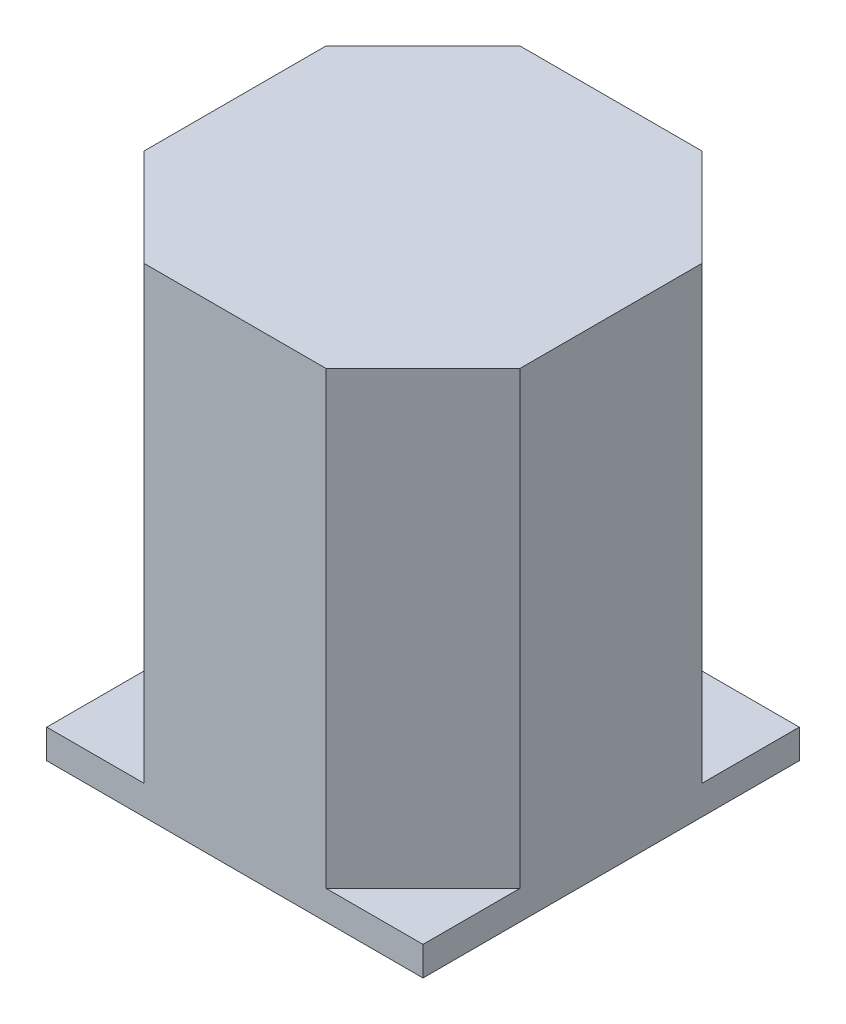
ISO-10303-21;
HEADER;
FILE_DESCRIPTION(('STEP AP214'),'2;1');
FILE_NAME('part.step','',(''),(''),'','','');
FILE_SCHEMA(('AUTOMOTIVE_DESIGN { 1 0 10303 214 1 1 1 1 }'));
ENDSEC;
DATA;
#1=APPLICATION_CONTEXT('core data for automotive mechanical design processes');
#2=APPLICATION_PROTOCOL_DEFINITION('international standard','automotive_design',2000,#1);
#3=PRODUCT_CONTEXT('',#1,'mechanical');
#4=PRODUCT('Part','Part','',(#3));
#5=PRODUCT_RELATED_PRODUCT_CATEGORY('part','',(#4));
#6=PRODUCT_DEFINITION_FORMATION('','',#4);
#7=PRODUCT_DEFINITION_CONTEXT('part definition',#1,'design');
#8=PRODUCT_DEFINITION('design','',#6,#7);
#9=PRODUCT_DEFINITION_SHAPE('','',#8);
#10=(LENGTH_UNIT() NAMED_UNIT(*) SI_UNIT(.MILLI.,.METRE.));
#11=(NAMED_UNIT(*) PLANE_ANGLE_UNIT() SI_UNIT($,.RADIAN.));
#12=(NAMED_UNIT(*) SI_UNIT($,.STERADIAN.) SOLID_ANGLE_UNIT());
#13=UNCERTAINTY_MEASURE_WITH_UNIT(LENGTH_MEASURE(1.E-05),#10,'distance_accuracy_value','');
#14=(GEOMETRIC_REPRESENTATION_CONTEXT(3) GLOBAL_UNCERTAINTY_ASSIGNED_CONTEXT((#13)) GLOBAL_UNIT_ASSIGNED_CONTEXT((#10,
#11,#12)) REPRESENTATION_CONTEXT('',''));
#15=CARTESIAN_POINT('',(0.,0.,0.));
#16=DIRECTION('',(0.,0.,1.));
#17=DIRECTION('',(1.,0.,0.));
#18=AXIS2_PLACEMENT_3D('',#15,#16,#17);
#19=CARTESIAN_POINT('',(260.145154707633,249.495838716891,675.18038003442));
#20=DIRECTION('',(0.,1.,0.));
#21=DIRECTION('',(1.,0.,0.));
#22=AXIS2_PLACEMENT_3D('',#19,#20,#21);
#23=PLANE('',#22);
#24=DIRECTION('',(0.,0.,1.));
#25=VECTOR('',#24,1.);
#26=CARTESIAN_POINT('',(337.645154707633,249.495838716886,675.180380034425));
#27=LINE('',#26,#25);
#28=CARTESIAN_POINT('',(337.645154707636,249.495838716886,637.680380034425));
#29=VERTEX_POINT('',#28);
#30=CARTESIAN_POINT('',(337.645154707631,249.495838716886,712.680380034425));
#31=VERTEX_POINT('',#30);
#32=EDGE_CURVE('E135',#29,#31,#27,.T.);
#33=ORIENTED_EDGE('',*,*,#32,.F.);
#34=DIRECTION('',(0.707106781186502,0.,0.707106781186593));
#35=VECTOR('',#34,1.);
#36=CARTESIAN_POINT('',(317.645154707636,249.495838716887,617.680380034424));
#37=LINE('',#36,#35);
#38=CARTESIAN_POINT('',(297.645154707638,249.495838716888,597.680380034422));
#39=VERTEX_POINT('',#38);
#40=EDGE_CURVE('E237',#29,#39,#37,.F.);
#41=ORIENTED_EDGE('',*,*,#40,.T.);
#42=DIRECTION('',(1.,0.,0.));
#43=VECTOR('',#42,1.);
#44=CARTESIAN_POINT('',(260.145154707638,249.495838716891,597.68038003442));
#45=LINE('',#44,#43);
#46=CARTESIAN_POINT('',(222.645154707638,249.495838716893,597.680380034418));
#47=VERTEX_POINT('',#46);
#48=EDGE_CURVE('E139',#47,#39,#45,.T.);
#49=ORIENTED_EDGE('',*,*,#48,.F.);
#50=DIRECTION('',(0.707106781186594,0.,-0.707106781186501));
#51=VECTOR('',#50,1.);
#52=CARTESIAN_POINT('',(202.645154707636,249.495838716894,617.680380034416));
#53=LINE('',#52,#51);
#54=CARTESIAN_POINT('',(182.645154707635,249.495838716896,637.680380034415));
#55=VERTEX_POINT('',#54);
#56=EDGE_CURVE('E232',#47,#55,#53,.F.);
#57=ORIENTED_EDGE('',*,*,#56,.T.);
#58=DIRECTION('',(0.,0.,-1.));
#59=VECTOR('',#58,1.);
#60=CARTESIAN_POINT('',(182.645154707633,249.495838716896,675.180380034415));
#61=LINE('',#60,#59);
#62=CARTESIAN_POINT('',(182.645154707631,249.495838716896,712.680380034415));
#63=VERTEX_POINT('',#62);
#64=EDGE_CURVE('E258',#63,#55,#61,.T.);
#65=ORIENTED_EDGE('',*,*,#64,.F.);
#66=DIRECTION('',(-0.707106781186502,0.,-0.707106781186593));
#67=VECTOR('',#66,1.);
#68=CARTESIAN_POINT('',(202.645154707629,249.495838716894,732.680380034416));
#69=LINE('',#68,#67);
#70=CARTESIAN_POINT('',(222.645154707628,249.495838716893,752.680380034418));
#71=VERTEX_POINT('',#70);
#72=EDGE_CURVE('E244',#63,#71,#69,.F.);
#73=ORIENTED_EDGE('',*,*,#72,.T.);
#74=DIRECTION('',(-1.,0.,0.));
#75=VECTOR('',#74,1.);
#76=CARTESIAN_POINT('',(260.145154707628,249.495838716891,752.68038003442));
#77=LINE('',#76,#75);
#78=CARTESIAN_POINT('',(297.645154707628,249.495838716888,752.680380034422));
#79=VERTEX_POINT('',#78);
#80=EDGE_CURVE('E256',#79,#71,#77,.T.);
#81=ORIENTED_EDGE('',*,*,#80,.F.);
#82=DIRECTION('',(-0.707106781186594,0.,0.707106781186501));
#83=VECTOR('',#82,1.);
#84=CARTESIAN_POINT('',(317.645154707629,249.495838716887,732.680380034424));
#85=LINE('',#84,#83);
#86=EDGE_CURVE('E240',#79,#31,#85,.F.);
#87=ORIENTED_EDGE('',*,*,#86,.T.);
#88=EDGE_LOOP('',(#33,#41,#49,#57,#65,#73,#81,#87));
#89=FACE_BOUND('',#88,.T.);
#90=ADVANCED_FACE('F16',(#89),#23,.T.);
#91=CARTESIAN_POINT('',(260.145154707616,63.9958387168907,752.68038003442));
#92=DIRECTION('',(0.,0.,1.));
#93=DIRECTION('',(0.,-1.,0.));
#94=AXIS2_PLACEMENT_3D('',#91,#92,#93);
#95=PLANE('',#94);
#96=DIRECTION('',(0.,-1.,0.));
#97=VECTOR('',#96,1.);
#98=CARTESIAN_POINT('',(222.645154707616,63.9958387168932,752.680380034418));
#99=LINE('',#98,#97);
#100=CARTESIAN_POINT('',(222.645154707616,63.9958387168932,752.680380034418));
#101=VERTEX_POINT('',#100);
#102=EDGE_CURVE('E185',#71,#101,#99,.T.);
#103=ORIENTED_EDGE('',*,*,#102,.T.);
#104=DIRECTION('',(-1.,0.,0.));
#105=VECTOR('',#104,1.);
#106=CARTESIAN_POINT('',(337.645154707616,63.9958387168857,752.680380034425));
#107=LINE('',#106,#105);
#108=CARTESIAN_POINT('',(182.645154707616,63.9958387168959,752.680380034415));
#109=VERTEX_POINT('',#108);
#110=EDGE_CURVE('E151',#101,#109,#107,.T.);
#111=ORIENTED_EDGE('',*,*,#110,.T.);
#112=DIRECTION('',(0.,-1.,0.));
#113=VECTOR('',#112,1.);
#114=CARTESIAN_POINT('',(182.645154707615,51.9958387168958,752.680380034415));
#115=LINE('',#114,#113);
#116=CARTESIAN_POINT('',(182.645154707615,51.9958387168958,752.680380034415));
#117=VERTEX_POINT('',#116);
#118=EDGE_CURVE('E127',#109,#117,#115,.T.);
#119=ORIENTED_EDGE('',*,*,#118,.T.);
#120=DIRECTION('',(-1.,0.,0.));
#121=VECTOR('',#120,1.);
#122=CARTESIAN_POINT('',(337.645154707615,51.9958387168857,752.680380034425));
#123=LINE('',#122,#121);
#124=CARTESIAN_POINT('',(337.645154707615,51.9958387168857,752.680380034425));
#125=VERTEX_POINT('',#124);
#126=EDGE_CURVE('E182',#125,#117,#123,.T.);
#127=ORIENTED_EDGE('',*,*,#126,.F.);
#128=DIRECTION('',(0.,-1.,0.));
#129=VECTOR('',#128,1.);
#130=CARTESIAN_POINT('',(337.645154707615,51.9958387168857,752.680380034425));
#131=LINE('',#130,#129);
#132=CARTESIAN_POINT('',(337.645154707616,63.9958387168857,752.680380034425));
#133=VERTEX_POINT('',#132);
#134=EDGE_CURVE('E152',#133,#125,#131,.T.);
#135=ORIENTED_EDGE('',*,*,#134,.F.);
#136=CARTESIAN_POINT('',(297.645154707616,63.9958387168883,752.680380034422));
#137=VERTEX_POINT('',#136);
#138=EDGE_CURVE('E186',#133,#137,#107,.T.);
#139=ORIENTED_EDGE('',*,*,#138,.T.);
#140=DIRECTION('',(0.,1.,0.));
#141=VECTOR('',#140,1.);
#142=CARTESIAN_POINT('',(297.645154707616,63.9958387168883,752.680380034422));
#143=LINE('',#142,#141);
#144=EDGE_CURVE('E198',#137,#79,#143,.T.);
#145=ORIENTED_EDGE('',*,*,#144,.T.);
#146=ORIENTED_EDGE('',*,*,#80,.T.);
#147=EDGE_LOOP('',(#103,#111,#119,#127,#135,#139,#145,#146));
#148=FACE_BOUND('',#147,.T.);
#149=ADVANCED_FACE('F180',(#148),#95,.T.);
#150=CARTESIAN_POINT('',(182.645154707621,63.9958387168959,675.180380034415));
#151=DIRECTION('',(-1.,0.,0.));
#152=DIRECTION('',(0.,1.,0.));
#153=AXIS2_PLACEMENT_3D('',#150,#151,#152);
#154=PLANE('',#153);
#155=DIRECTION('',(0.,-1.,0.));
#156=VECTOR('',#155,1.);
#157=CARTESIAN_POINT('',(182.645154707624,63.9958387168959,637.680380034415));
#158=LINE('',#157,#156);
#159=CARTESIAN_POINT('',(182.645154707624,63.9958387168959,637.680380034415));
#160=VERTEX_POINT('',#159);
#161=EDGE_CURVE('E24',#55,#160,#158,.T.);
#162=ORIENTED_EDGE('',*,*,#161,.T.);
#163=DIRECTION('',(0.,0.,1.));
#164=VECTOR('',#163,1.);
#165=CARTESIAN_POINT('',(182.645154707626,63.9958387168959,597.680380034415));
#166=LINE('',#165,#164);
#167=CARTESIAN_POINT('',(182.645154707626,63.9958387168959,597.680380034415));
#168=VERTEX_POINT('',#167);
#169=EDGE_CURVE('E166',#168,#160,#166,.T.);
#170=ORIENTED_EDGE('',*,*,#169,.F.);
#171=DIRECTION('',(0.,-1.,0.));
#172=VECTOR('',#171,1.);
#173=CARTESIAN_POINT('',(182.645154707625,51.9958387168958,597.680380034415));
#174=LINE('',#173,#172);
#175=CARTESIAN_POINT('',(182.645154707625,51.9958387168958,597.680380034415));
#176=VERTEX_POINT('',#175);
#177=EDGE_CURVE('E141',#168,#176,#174,.T.);
#178=ORIENTED_EDGE('',*,*,#177,.T.);
#179=DIRECTION('',(0.,0.,1.));
#180=VECTOR('',#179,1.);
#181=CARTESIAN_POINT('',(182.645154707625,51.9958387168958,597.680380034415));
#182=LINE('',#181,#180);
#183=EDGE_CURVE('E148',#176,#117,#182,.T.);
#184=ORIENTED_EDGE('',*,*,#183,.T.);
#185=ORIENTED_EDGE('',*,*,#118,.F.);
#186=CARTESIAN_POINT('',(182.645154707619,63.9958387168959,712.680380034415));
#187=VERTEX_POINT('',#186);
#188=EDGE_CURVE('E116',#187,#109,#166,.T.);
#189=ORIENTED_EDGE('',*,*,#188,.F.);
#190=DIRECTION('',(0.,1.,0.));
#191=VECTOR('',#190,1.);
#192=CARTESIAN_POINT('',(182.645154707619,63.9958387168959,712.680380034415));
#193=LINE('',#192,#191);
#194=EDGE_CURVE('E11',#187,#63,#193,.T.);
#195=ORIENTED_EDGE('',*,*,#194,.T.);
#196=ORIENTED_EDGE('',*,*,#64,.T.);
#197=EDGE_LOOP('',(#162,#170,#178,#184,#185,#189,#195,#196));
#198=FACE_BOUND('',#197,.T.);
#199=ADVANCED_FACE('F178',(#198),#154,.T.);
#200=CARTESIAN_POINT('',(260.145154707626,63.9958387168907,597.68038003442));
#201=DIRECTION('',(0.,0.,-1.));
#202=DIRECTION('',(0.,1.,0.));
#203=AXIS2_PLACEMENT_3D('',#200,#201,#202);
#204=PLANE('',#203);
#205=ORIENTED_EDGE('',*,*,#48,.T.);
#206=DIRECTION('',(0.,-1.,0.));
#207=VECTOR('',#206,1.);
#208=CARTESIAN_POINT('',(297.645154707626,63.9958387168883,597.680380034422));
#209=LINE('',#208,#207);
#210=CARTESIAN_POINT('',(297.645154707626,63.9958387168883,597.680380034422));
#211=VERTEX_POINT('',#210);
#212=EDGE_CURVE('E126',#39,#211,#209,.T.);
#213=ORIENTED_EDGE('',*,*,#212,.T.);
#214=DIRECTION('',(-1.,0.,0.));
#215=VECTOR('',#214,1.);
#216=CARTESIAN_POINT('',(337.645154707626,63.9958387168857,597.680380034425));
#217=LINE('',#216,#215);
#218=CARTESIAN_POINT('',(337.645154707626,63.9958387168857,597.680380034425));
#219=VERTEX_POINT('',#218);
#220=EDGE_CURVE('E110',#219,#211,#217,.T.);
#221=ORIENTED_EDGE('',*,*,#220,.F.);
#222=DIRECTION('',(0.,-1.,0.));
#223=VECTOR('',#222,1.);
#224=CARTESIAN_POINT('',(337.645154707625,51.9958387168857,597.680380034425));
#225=LINE('',#224,#223);
#226=CARTESIAN_POINT('',(337.645154707625,51.9958387168857,597.680380034425));
#227=VERTEX_POINT('',#226);
#228=EDGE_CURVE('E124',#219,#227,#225,.T.);
#229=ORIENTED_EDGE('',*,*,#228,.T.);
#230=DIRECTION('',(-1.,0.,0.));
#231=VECTOR('',#230,1.);
#232=CARTESIAN_POINT('',(337.645154707625,51.9958387168857,597.680380034425));
#233=LINE('',#232,#231);
#234=EDGE_CURVE('E136',#227,#176,#233,.T.);
#235=ORIENTED_EDGE('',*,*,#234,.T.);
#236=ORIENTED_EDGE('',*,*,#177,.F.);
#237=CARTESIAN_POINT('',(222.645154707626,63.9958387168932,597.680380034418));
#238=VERTEX_POINT('',#237);
#239=EDGE_CURVE('E128',#238,#168,#217,.T.);
#240=ORIENTED_EDGE('',*,*,#239,.F.);
#241=DIRECTION('',(0.,1.,0.));
#242=VECTOR('',#241,1.);
#243=CARTESIAN_POINT('',(222.645154707626,63.9958387168932,597.680380034418));
#244=LINE('',#243,#242);
#245=EDGE_CURVE('E224',#238,#47,#244,.T.);
#246=ORIENTED_EDGE('',*,*,#245,.T.);
#247=EDGE_LOOP('',(#205,#213,#221,#229,#235,#236,#240,#246));
#248=FACE_BOUND('',#247,.T.);
#249=ADVANCED_FACE('F122',(#248),#204,.T.);
#250=CARTESIAN_POINT('',(337.645154707621,63.9958387168857,675.180380034425));
#251=DIRECTION('',(1.,0.,0.));
#252=DIRECTION('',(0.,-1.,0.));
#253=AXIS2_PLACEMENT_3D('',#250,#251,#252);
#254=PLANE('',#253);
#255=DIRECTION('',(0.,-1.,0.));
#256=VECTOR('',#255,1.);
#257=CARTESIAN_POINT('',(337.645154707619,63.9958387168857,712.680380034425));
#258=LINE('',#257,#256);
#259=CARTESIAN_POINT('',(337.645154707619,63.9958387168857,712.680380034425));
#260=VERTEX_POINT('',#259);
#261=EDGE_CURVE('E233',#31,#260,#258,.T.);
#262=ORIENTED_EDGE('',*,*,#261,.T.);
#263=DIRECTION('',(0.,0.,1.));
#264=VECTOR('',#263,1.);
#265=CARTESIAN_POINT('',(337.645154707626,63.9958387168857,597.680380034425));
#266=LINE('',#265,#264);
#267=EDGE_CURVE('E117',#260,#133,#266,.T.);
#268=ORIENTED_EDGE('',*,*,#267,.T.);
#269=ORIENTED_EDGE('',*,*,#134,.T.);
#270=DIRECTION('',(0.,0.,1.));
#271=VECTOR('',#270,1.);
#272=CARTESIAN_POINT('',(337.645154707625,51.9958387168857,597.680380034425));
#273=LINE('',#272,#271);
#274=EDGE_CURVE('E133',#227,#125,#273,.T.);
#275=ORIENTED_EDGE('',*,*,#274,.F.);
#276=ORIENTED_EDGE('',*,*,#228,.F.);
#277=CARTESIAN_POINT('',(337.645154707624,63.9958387168857,637.680380034425));
#278=VERTEX_POINT('',#277);
#279=EDGE_CURVE('E107',#219,#278,#266,.T.);
#280=ORIENTED_EDGE('',*,*,#279,.T.);
#281=DIRECTION('',(0.,1.,0.));
#282=VECTOR('',#281,1.);
#283=CARTESIAN_POINT('',(337.645154707624,63.9958387168857,637.680380034425));
#284=LINE('',#283,#282);
#285=EDGE_CURVE('E230',#278,#29,#284,.T.);
#286=ORIENTED_EDGE('',*,*,#285,.T.);
#287=ORIENTED_EDGE('',*,*,#32,.T.);
#288=EDGE_LOOP('',(#262,#268,#269,#275,#276,#280,#286,#287));
#289=FACE_BOUND('',#288,.T.);
#290=ADVANCED_FACE('F130',(#289),#254,.T.);
#291=CARTESIAN_POINT('',(337.645154707624,63.9958387168857,637.680380034425));
#292=DIRECTION('',(-0.707106781186593,0.,0.707106781186502));
#293=DIRECTION('',(0.707106781186502,0.,0.707106781186593));
#294=AXIS2_PLACEMENT_3D('',#291,#292,#293);
#295=PLANE('',#294);
#296=DIRECTION('',(-0.707106781186502,0.,-0.707106781186593));
#297=VECTOR('',#296,1.);
#298=CARTESIAN_POINT('',(317.645154707624,63.995838716887,617.680380034424));
#299=LINE('',#298,#297);
#300=EDGE_CURVE('E112',#211,#278,#299,.F.);
#301=ORIENTED_EDGE('',*,*,#300,.F.);
#302=ORIENTED_EDGE('',*,*,#212,.F.);
#303=ORIENTED_EDGE('',*,*,#40,.F.);
#304=ORIENTED_EDGE('',*,*,#285,.F.);
#305=EDGE_LOOP('',(#301,#302,#303,#304));
#306=FACE_BOUND('',#305,.T.);
#307=ADVANCED_FACE('F261',(#306),#295,.F.);
#308=CARTESIAN_POINT('',(297.645154707616,63.9958387168883,752.680380034422));
#309=DIRECTION('',(-0.707106781186501,0.,-0.707106781186594));
#310=DIRECTION('',(-0.707106781186594,0.,0.707106781186501));
#311=AXIS2_PLACEMENT_3D('',#308,#309,#310);
#312=PLANE('',#311);
#313=DIRECTION('',(0.707106781186594,0.,-0.707106781186501));
#314=VECTOR('',#313,1.);
#315=CARTESIAN_POINT('',(317.645154707617,63.995838716887,732.680380034424));
#316=LINE('',#315,#314);
#317=EDGE_CURVE('E204',#260,#137,#316,.F.);
#318=ORIENTED_EDGE('',*,*,#317,.F.);
#319=ORIENTED_EDGE('',*,*,#261,.F.);
#320=ORIENTED_EDGE('',*,*,#86,.F.);
#321=ORIENTED_EDGE('',*,*,#144,.F.);
#322=EDGE_LOOP('',(#318,#319,#320,#321));
#323=FACE_BOUND('',#322,.T.);
#324=ADVANCED_FACE('F262',(#323),#312,.F.);
#325=CARTESIAN_POINT('',(182.645154707619,63.9958387168959,712.680380034415));
#326=DIRECTION('',(0.707106781186593,0.,-0.707106781186502));
#327=DIRECTION('',(-0.707106781186502,0.,-0.707106781186593));
#328=AXIS2_PLACEMENT_3D('',#325,#326,#327);
#329=PLANE('',#328);
#330=DIRECTION('',(0.707106781186502,0.,0.707106781186593));
#331=VECTOR('',#330,1.);
#332=CARTESIAN_POINT('',(202.645154707617,63.9958387168945,732.680380034416));
#333=LINE('',#332,#331);
#334=EDGE_CURVE('E176',#101,#187,#333,.F.);
#335=ORIENTED_EDGE('',*,*,#334,.F.);
#336=ORIENTED_EDGE('',*,*,#102,.F.);
#337=ORIENTED_EDGE('',*,*,#72,.F.);
#338=ORIENTED_EDGE('',*,*,#194,.F.);
#339=EDGE_LOOP('',(#335,#336,#337,#338));
#340=FACE_BOUND('',#339,.T.);
#341=ADVANCED_FACE('F265',(#340),#329,.F.);
#342=CARTESIAN_POINT('',(222.645154707626,63.9958387168932,597.680380034418));
#343=DIRECTION('',(0.707106781186501,0.,0.707106781186594));
#344=DIRECTION('',(0.707106781186594,0.,-0.707106781186501));
#345=AXIS2_PLACEMENT_3D('',#342,#343,#344);
#346=PLANE('',#345);
#347=DIRECTION('',(-0.707106781186594,0.,0.707106781186501));
#348=VECTOR('',#347,1.);
#349=CARTESIAN_POINT('',(202.645154707624,63.9958387168945,617.680380034416));
#350=LINE('',#349,#348);
#351=EDGE_CURVE('E209',#160,#238,#350,.F.);
#352=ORIENTED_EDGE('',*,*,#351,.F.);
#353=ORIENTED_EDGE('',*,*,#161,.F.);
#354=ORIENTED_EDGE('',*,*,#56,.F.);
#355=ORIENTED_EDGE('',*,*,#245,.F.);
#356=EDGE_LOOP('',(#352,#353,#354,#355));
#357=FACE_BOUND('',#356,.T.);
#358=ADVANCED_FACE('F272',(#357),#346,.F.);
#359=CARTESIAN_POINT('',(337.645154707616,63.9958387168857,752.680380034425));
#360=DIRECTION('',(0.,1.,0.));
#361=DIRECTION('',(1.,0.,0.));
#362=AXIS2_PLACEMENT_3D('',#359,#360,#361);
#363=PLANE('',#362);
#364=ORIENTED_EDGE('',*,*,#220,.T.);
#365=ORIENTED_EDGE('',*,*,#300,.T.);
#366=ORIENTED_EDGE('',*,*,#279,.F.);
#367=EDGE_LOOP('',(#364,#365,#366));
#368=FACE_BOUND('',#367,.T.);
#369=ADVANCED_FACE('F109',(#368),#363,.T.);
#370=ORIENTED_EDGE('',*,*,#267,.F.);
#371=ORIENTED_EDGE('',*,*,#317,.T.);
#372=ORIENTED_EDGE('',*,*,#138,.F.);
#373=EDGE_LOOP('',(#370,#371,#372));
#374=FACE_BOUND('',#373,.T.);
#375=ADVANCED_FACE('F202',(#374),#363,.T.);
#376=ORIENTED_EDGE('',*,*,#110,.F.);
#377=ORIENTED_EDGE('',*,*,#334,.T.);
#378=ORIENTED_EDGE('',*,*,#188,.T.);
#379=EDGE_LOOP('',(#376,#377,#378));
#380=FACE_BOUND('',#379,.T.);
#381=ADVANCED_FACE('F175',(#380),#363,.T.);
#382=ORIENTED_EDGE('',*,*,#169,.T.);
#383=ORIENTED_EDGE('',*,*,#351,.T.);
#384=ORIENTED_EDGE('',*,*,#239,.T.);
#385=EDGE_LOOP('',(#382,#383,#384));
#386=FACE_BOUND('',#385,.T.);
#387=ADVANCED_FACE('F336',(#386),#363,.T.);
#388=CARTESIAN_POINT('',(337.645154707625,51.9958387168857,597.680380034425));
#389=DIRECTION('',(0.,-1.,0.));
#390=DIRECTION('',(-1.,0.,0.));
#391=AXIS2_PLACEMENT_3D('',#388,#389,#390);
#392=PLANE('',#391);
#393=ORIENTED_EDGE('',*,*,#234,.F.);
#394=ORIENTED_EDGE('',*,*,#274,.T.);
#395=ORIENTED_EDGE('',*,*,#126,.T.);
#396=ORIENTED_EDGE('',*,*,#183,.F.);
#397=EDGE_LOOP('',(#393,#394,#395,#396));
#398=FACE_BOUND('',#397,.T.);
#399=ADVANCED_FACE('F194',(#398),#392,.T.);
#400=CLOSED_SHELL('',(#90,#149,#199,#249,#290,#307,#324,#341,#358,#369,#375,#381,#387,#399));
#401=MANIFOLD_SOLID_BREP('B1',#400);
#402=ADVANCED_BREP_SHAPE_REPRESENTATION('',(#18,#401),#14);
#403=SHAPE_DEFINITION_REPRESENTATION(#9,#402);
ENDSEC;
END-ISO-10303-21;
